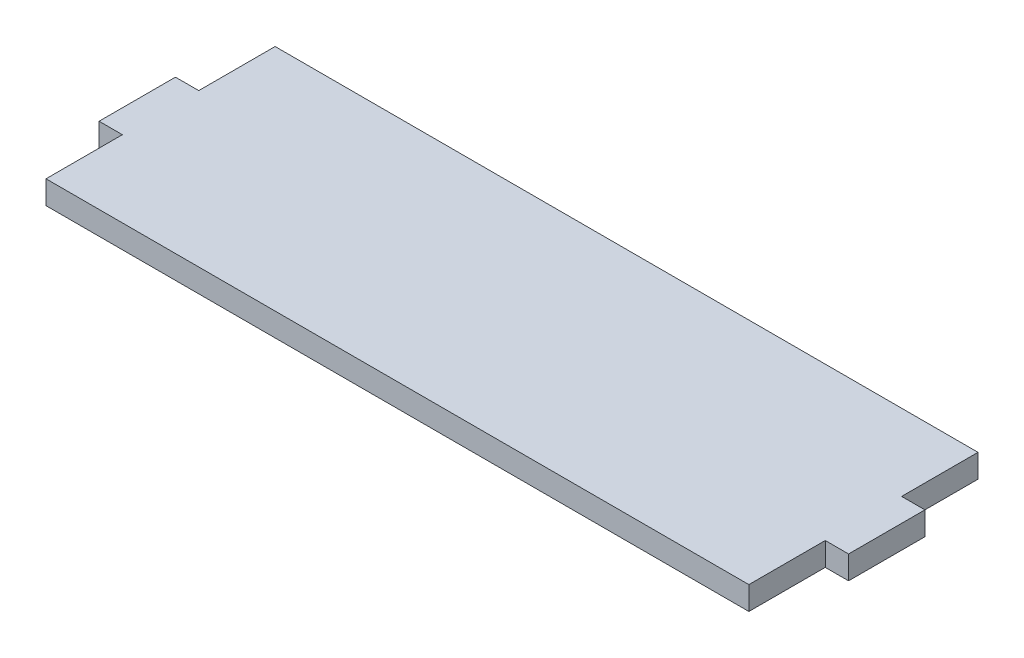
ISO-10303-21;
HEADER;
FILE_DESCRIPTION(('STEP AP214'),'2;1');
FILE_NAME('part.step','',(''),(''),'','','');
FILE_SCHEMA(('AUTOMOTIVE_DESIGN { 1 0 10303 214 1 1 1 1 }'));
ENDSEC;
DATA;
#1=APPLICATION_CONTEXT('core data for automotive mechanical design processes');
#2=APPLICATION_PROTOCOL_DEFINITION('international standard','automotive_design',2000,#1);
#3=PRODUCT_CONTEXT('',#1,'mechanical');
#4=PRODUCT('Part','Part','',(#3));
#5=PRODUCT_RELATED_PRODUCT_CATEGORY('part','',(#4));
#6=PRODUCT_DEFINITION_FORMATION('','',#4);
#7=PRODUCT_DEFINITION_CONTEXT('part definition',#1,'design');
#8=PRODUCT_DEFINITION('design','',#6,#7);
#9=PRODUCT_DEFINITION_SHAPE('','',#8);
#10=(LENGTH_UNIT() NAMED_UNIT(*) SI_UNIT(.MILLI.,.METRE.));
#11=(NAMED_UNIT(*) PLANE_ANGLE_UNIT() SI_UNIT($,.RADIAN.));
#12=(NAMED_UNIT(*) SI_UNIT($,.STERADIAN.) SOLID_ANGLE_UNIT());
#13=UNCERTAINTY_MEASURE_WITH_UNIT(LENGTH_MEASURE(1.E-05),#10,'distance_accuracy_value','');
#14=(GEOMETRIC_REPRESENTATION_CONTEXT(3) GLOBAL_UNCERTAINTY_ASSIGNED_CONTEXT((#13)) GLOBAL_UNIT_ASSIGNED_CONTEXT((#10,
#11,#12)) REPRESENTATION_CONTEXT('',''));
#15=CARTESIAN_POINT('',(0.,0.,0.));
#16=DIRECTION('',(0.,0.,1.));
#17=DIRECTION('',(1.,0.,0.));
#18=AXIS2_PLACEMENT_3D('',#15,#16,#17);
#19=CARTESIAN_POINT('',(-96.5,6.00000000000001,-29.5));
#20=DIRECTION('',(0.,0.,-1.));
#21=DIRECTION('',(-1.,0.,0.));
#22=AXIS2_PLACEMENT_3D('',#19,#20,#21);
#23=PLANE('',#22);
#24=DIRECTION('',(1.,0.,0.));
#25=VECTOR('',#24,1.);
#26=CARTESIAN_POINT('',(-96.5,6.00000000000001,-29.5));
#27=LINE('',#26,#25);
#28=CARTESIAN_POINT('',(-90.5,6.00000000000001,-29.5));
#29=VERTEX_POINT('',#28);
#30=CARTESIAN_POINT('',(90.5,6.00000000000001,-29.5));
#31=VERTEX_POINT('',#30);
#32=EDGE_CURVE('E156',#29,#31,#27,.T.);
#33=ORIENTED_EDGE('',*,*,#32,.T.);
#34=DIRECTION('',(0.,-1.,0.));
#35=VECTOR('',#34,1.);
#36=CARTESIAN_POINT('',(90.5,6.00000000000001,-29.5));
#37=LINE('',#36,#35);
#38=CARTESIAN_POINT('',(90.5,0.,-29.5));
#39=VERTEX_POINT('',#38);
#40=EDGE_CURVE('E209',#31,#39,#37,.T.);
#41=ORIENTED_EDGE('',*,*,#40,.T.);
#42=DIRECTION('',(1.,0.,0.));
#43=VECTOR('',#42,1.);
#44=CARTESIAN_POINT('',(-96.5,0.,-29.5));
#45=LINE('',#44,#43);
#46=CARTESIAN_POINT('',(-90.5,0.,-29.5));
#47=VERTEX_POINT('',#46);
#48=EDGE_CURVE('E160',#47,#39,#45,.T.);
#49=ORIENTED_EDGE('',*,*,#48,.F.);
#50=DIRECTION('',(0.,-1.,0.));
#51=VECTOR('',#50,1.);
#52=CARTESIAN_POINT('',(-90.5,6.00000000000001,-29.5));
#53=LINE('',#52,#51);
#54=EDGE_CURVE('E177',#29,#47,#53,.T.);
#55=ORIENTED_EDGE('',*,*,#54,.F.);
#56=EDGE_LOOP('',(#33,#41,#49,#55));
#57=FACE_BOUND('',#56,.T.);
#58=ADVANCED_FACE('F37',(#57),#23,.T.);
#59=CARTESIAN_POINT('',(-96.5,6.00000000000001,29.5));
#60=DIRECTION('',(0.,0.,-1.));
#61=DIRECTION('',(-1.,0.,0.));
#62=AXIS2_PLACEMENT_3D('',#59,#60,#61);
#63=PLANE('',#62);
#64=DIRECTION('',(0.,-1.,0.));
#65=VECTOR('',#64,1.);
#66=CARTESIAN_POINT('',(90.5,6.00000000000001,29.5));
#67=LINE('',#66,#65);
#68=CARTESIAN_POINT('',(90.5,6.00000000000001,29.5));
#69=VERTEX_POINT('',#68);
#70=CARTESIAN_POINT('',(90.5,0.,29.5));
#71=VERTEX_POINT('',#70);
#72=EDGE_CURVE('E129',#69,#71,#67,.T.);
#73=ORIENTED_EDGE('',*,*,#72,.F.);
#74=DIRECTION('',(1.,0.,0.));
#75=VECTOR('',#74,1.);
#76=CARTESIAN_POINT('',(-96.5,6.00000000000001,29.5));
#77=LINE('',#76,#75);
#78=CARTESIAN_POINT('',(-90.5,6.00000000000001,29.5));
#79=VERTEX_POINT('',#78);
#80=EDGE_CURVE('E45',#79,#69,#77,.T.);
#81=ORIENTED_EDGE('',*,*,#80,.F.);
#82=DIRECTION('',(0.,-1.,0.));
#83=VECTOR('',#82,1.);
#84=CARTESIAN_POINT('',(-90.5,6.00000000000001,29.5));
#85=LINE('',#84,#83);
#86=CARTESIAN_POINT('',(-90.5,0.,29.5));
#87=VERTEX_POINT('',#86);
#88=EDGE_CURVE('E197',#79,#87,#85,.T.);
#89=ORIENTED_EDGE('',*,*,#88,.T.);
#90=DIRECTION('',(1.,0.,0.));
#91=VECTOR('',#90,1.);
#92=CARTESIAN_POINT('',(-96.5,0.,29.5));
#93=LINE('',#92,#91);
#94=EDGE_CURVE('E144',#87,#71,#93,.T.);
#95=ORIENTED_EDGE('',*,*,#94,.T.);
#96=EDGE_LOOP('',(#73,#81,#89,#95));
#97=FACE_BOUND('',#96,.T.);
#98=ADVANCED_FACE('F141',(#97),#63,.F.);
#99=CARTESIAN_POINT('',(0.,6.00000000000001,0.));
#100=DIRECTION('',(0.,-1.,0.));
#101=DIRECTION('',(0.,0.,-1.));
#102=AXIS2_PLACEMENT_3D('',#99,#100,#101);
#103=PLANE('',#102);
#104=DIRECTION('',(0.,0.,1.));
#105=VECTOR('',#104,1.);
#106=CARTESIAN_POINT('',(90.5,6.00000000000001,0.));
#107=LINE('',#106,#105);
#108=CARTESIAN_POINT('',(90.5,6.00000000000001,9.83333333333334));
#109=VERTEX_POINT('',#108);
#110=EDGE_CURVE('E126',#109,#69,#107,.T.);
#111=ORIENTED_EDGE('',*,*,#110,.F.);
#112=DIRECTION('',(1.,0.,0.));
#113=VECTOR('',#112,1.);
#114=CARTESIAN_POINT('',(0.,6.00000000000001,9.83333333333331));
#115=LINE('',#114,#113);
#116=CARTESIAN_POINT('',(96.5,6.00000000000001,9.83333333333334));
#117=VERTEX_POINT('',#116);
#118=EDGE_CURVE('E135',#109,#117,#115,.T.);
#119=ORIENTED_EDGE('',*,*,#118,.T.);
#120=DIRECTION('',(0.,0.,1.));
#121=VECTOR('',#120,1.);
#122=CARTESIAN_POINT('',(96.5,6.00000000000001,-29.5));
#123=LINE('',#122,#121);
#124=CARTESIAN_POINT('',(96.5,6.00000000000001,-9.83333333333333));
#125=VERTEX_POINT('',#124);
#126=EDGE_CURVE('E153',#125,#117,#123,.T.);
#127=ORIENTED_EDGE('',*,*,#126,.F.);
#128=DIRECTION('',(-1.,0.,0.));
#129=VECTOR('',#128,1.);
#130=CARTESIAN_POINT('',(0.,6.00000000000001,-9.83333333333333));
#131=LINE('',#130,#129);
#132=CARTESIAN_POINT('',(90.5,6.00000000000001,-9.83333333333333));
#133=VERTEX_POINT('',#132);
#134=EDGE_CURVE('E211',#125,#133,#131,.T.);
#135=ORIENTED_EDGE('',*,*,#134,.T.);
#136=DIRECTION('',(0.,0.,1.));
#137=VECTOR('',#136,1.);
#138=CARTESIAN_POINT('',(90.5,6.00000000000001,0.));
#139=LINE('',#138,#137);
#140=EDGE_CURVE('E214',#31,#133,#139,.T.);
#141=ORIENTED_EDGE('',*,*,#140,.F.);
#142=ORIENTED_EDGE('',*,*,#32,.F.);
#143=DIRECTION('',(0.,0.,1.));
#144=VECTOR('',#143,1.);
#145=CARTESIAN_POINT('',(-90.5,6.00000000000001,0.));
#146=LINE('',#145,#144);
#147=CARTESIAN_POINT('',(-90.5,6.00000000000001,-9.83333333333333));
#148=VERTEX_POINT('',#147);
#149=EDGE_CURVE('E189',#29,#148,#146,.T.);
#150=ORIENTED_EDGE('',*,*,#149,.T.);
#151=DIRECTION('',(1.,0.,0.));
#152=VECTOR('',#151,1.);
#153=CARTESIAN_POINT('',(0.,6.00000000000001,-9.83333333333333));
#154=LINE('',#153,#152);
#155=CARTESIAN_POINT('',(-96.5,6.00000000000001,-9.83333333333333));
#156=VERTEX_POINT('',#155);
#157=EDGE_CURVE('E185',#156,#148,#154,.T.);
#158=ORIENTED_EDGE('',*,*,#157,.F.);
#159=DIRECTION('',(0.,0.,1.));
#160=VECTOR('',#159,1.);
#161=CARTESIAN_POINT('',(-96.5,6.00000000000001,-29.5));
#162=LINE('',#161,#160);
#163=CARTESIAN_POINT('',(-96.5,6.00000000000001,9.83333333333334));
#164=VERTEX_POINT('',#163);
#165=EDGE_CURVE('E11',#156,#164,#162,.T.);
#166=ORIENTED_EDGE('',*,*,#165,.T.);
#167=DIRECTION('',(-1.,0.,0.));
#168=VECTOR('',#167,1.);
#169=CARTESIAN_POINT('',(0.,6.00000000000001,9.83333333333331));
#170=LINE('',#169,#168);
#171=CARTESIAN_POINT('',(-90.5,6.00000000000001,9.83333333333334));
#172=VERTEX_POINT('',#171);
#173=EDGE_CURVE('E199',#172,#164,#170,.T.);
#174=ORIENTED_EDGE('',*,*,#173,.F.);
#175=DIRECTION('',(0.,0.,1.));
#176=VECTOR('',#175,1.);
#177=CARTESIAN_POINT('',(-90.5,6.00000000000001,0.));
#178=LINE('',#177,#176);
#179=EDGE_CURVE('E152',#172,#79,#178,.T.);
#180=ORIENTED_EDGE('',*,*,#179,.T.);
#181=ORIENTED_EDGE('',*,*,#80,.T.);
#182=EDGE_LOOP('',(#111,#119,#127,#135,#141,#142,#150,#158,#166,#174,#180,#181));
#183=FACE_BOUND('',#182,.T.);
#184=ADVANCED_FACE('F149',(#183),#103,.F.);
#185=CARTESIAN_POINT('',(0.,0.,0.));
#186=DIRECTION('',(0.,-1.,0.));
#187=DIRECTION('',(0.,0.,-1.));
#188=AXIS2_PLACEMENT_3D('',#185,#186,#187);
#189=PLANE('',#188);
#190=DIRECTION('',(1.,0.,0.));
#191=VECTOR('',#190,1.);
#192=CARTESIAN_POINT('',(0.,0.,9.83333333333331));
#193=LINE('',#192,#191);
#194=CARTESIAN_POINT('',(90.5,0.,9.83333333333334));
#195=VERTEX_POINT('',#194);
#196=CARTESIAN_POINT('',(96.5,0.,9.83333333333334));
#197=VERTEX_POINT('',#196);
#198=EDGE_CURVE('E136',#195,#197,#193,.T.);
#199=ORIENTED_EDGE('',*,*,#198,.F.);
#200=DIRECTION('',(0.,0.,1.));
#201=VECTOR('',#200,1.);
#202=CARTESIAN_POINT('',(90.5,0.,0.));
#203=LINE('',#202,#201);
#204=EDGE_CURVE('E53',#195,#71,#203,.T.);
#205=ORIENTED_EDGE('',*,*,#204,.T.);
#206=ORIENTED_EDGE('',*,*,#94,.F.);
#207=DIRECTION('',(0.,0.,1.));
#208=VECTOR('',#207,1.);
#209=CARTESIAN_POINT('',(-90.5,0.,0.));
#210=LINE('',#209,#208);
#211=CARTESIAN_POINT('',(-90.5,0.,9.83333333333334));
#212=VERTEX_POINT('',#211);
#213=EDGE_CURVE('E179',#212,#87,#210,.T.);
#214=ORIENTED_EDGE('',*,*,#213,.F.);
#215=DIRECTION('',(-1.,0.,0.));
#216=VECTOR('',#215,1.);
#217=CARTESIAN_POINT('',(0.,0.,9.83333333333331));
#218=LINE('',#217,#216);
#219=CARTESIAN_POINT('',(-96.5,0.,9.83333333333334));
#220=VERTEX_POINT('',#219);
#221=EDGE_CURVE('E200',#212,#220,#218,.T.);
#222=ORIENTED_EDGE('',*,*,#221,.T.);
#223=DIRECTION('',(0.,0.,1.));
#224=VECTOR('',#223,1.);
#225=CARTESIAN_POINT('',(-96.5,0.,-29.5));
#226=LINE('',#225,#224);
#227=CARTESIAN_POINT('',(-96.5,0.,-9.83333333333333));
#228=VERTEX_POINT('',#227);
#229=EDGE_CURVE('E40',#228,#220,#226,.T.);
#230=ORIENTED_EDGE('',*,*,#229,.F.);
#231=DIRECTION('',(1.,0.,0.));
#232=VECTOR('',#231,1.);
#233=CARTESIAN_POINT('',(0.,0.,-9.83333333333333));
#234=LINE('',#233,#232);
#235=CARTESIAN_POINT('',(-90.5,0.,-9.83333333333333));
#236=VERTEX_POINT('',#235);
#237=EDGE_CURVE('E186',#228,#236,#234,.T.);
#238=ORIENTED_EDGE('',*,*,#237,.T.);
#239=DIRECTION('',(0.,0.,1.));
#240=VECTOR('',#239,1.);
#241=CARTESIAN_POINT('',(-90.5,0.,0.));
#242=LINE('',#241,#240);
#243=EDGE_CURVE('E145',#47,#236,#242,.T.);
#244=ORIENTED_EDGE('',*,*,#243,.F.);
#245=ORIENTED_EDGE('',*,*,#48,.T.);
#246=DIRECTION('',(0.,0.,1.));
#247=VECTOR('',#246,1.);
#248=CARTESIAN_POINT('',(90.5,0.,0.));
#249=LINE('',#248,#247);
#250=CARTESIAN_POINT('',(90.5,0.,-9.83333333333333));
#251=VERTEX_POINT('',#250);
#252=EDGE_CURVE('E215',#39,#251,#249,.T.);
#253=ORIENTED_EDGE('',*,*,#252,.T.);
#254=DIRECTION('',(-1.,0.,0.));
#255=VECTOR('',#254,1.);
#256=CARTESIAN_POINT('',(0.,0.,-9.83333333333333));
#257=LINE('',#256,#255);
#258=CARTESIAN_POINT('',(96.5,0.,-9.83333333333333));
#259=VERTEX_POINT('',#258);
#260=EDGE_CURVE('E212',#259,#251,#257,.T.);
#261=ORIENTED_EDGE('',*,*,#260,.F.);
#262=DIRECTION('',(0.,0.,1.));
#263=VECTOR('',#262,1.);
#264=CARTESIAN_POINT('',(96.5,0.,-29.5));
#265=LINE('',#264,#263);
#266=EDGE_CURVE('E163',#259,#197,#265,.T.);
#267=ORIENTED_EDGE('',*,*,#266,.T.);
#268=EDGE_LOOP('',(#199,#205,#206,#214,#222,#230,#238,#244,#245,#253,#261,#267));
#269=FACE_BOUND('',#268,.T.);
#270=ADVANCED_FACE('F233',(#269),#189,.T.);
#271=CARTESIAN_POINT('',(-96.5,6.00000000000001,-29.5));
#272=DIRECTION('',(1.,0.,0.));
#273=DIRECTION('',(0.,0.,-1.));
#274=AXIS2_PLACEMENT_3D('',#271,#272,#273);
#275=PLANE('',#274);
#276=DIRECTION('',(0.,-1.,0.));
#277=VECTOR('',#276,1.);
#278=CARTESIAN_POINT('',(-96.5,6.00000000000001,9.83333333333334));
#279=LINE('',#278,#277);
#280=EDGE_CURVE('E195',#164,#220,#279,.T.);
#281=ORIENTED_EDGE('',*,*,#280,.F.);
#282=ORIENTED_EDGE('',*,*,#165,.F.);
#283=DIRECTION('',(0.,-1.,0.));
#284=VECTOR('',#283,1.);
#285=CARTESIAN_POINT('',(-96.5,6.00000000000001,-9.83333333333333));
#286=LINE('',#285,#284);
#287=EDGE_CURVE('E180',#156,#228,#286,.T.);
#288=ORIENTED_EDGE('',*,*,#287,.T.);
#289=ORIENTED_EDGE('',*,*,#229,.T.);
#290=EDGE_LOOP('',(#281,#282,#288,#289));
#291=FACE_BOUND('',#290,.T.);
#292=ADVANCED_FACE('F248',(#291),#275,.F.);
#293=CARTESIAN_POINT('',(96.5,6.00000000000001,-29.5));
#294=DIRECTION('',(1.,0.,0.));
#295=DIRECTION('',(0.,0.,-1.));
#296=AXIS2_PLACEMENT_3D('',#293,#294,#295);
#297=PLANE('',#296);
#298=DIRECTION('',(0.,-1.,0.));
#299=VECTOR('',#298,1.);
#300=CARTESIAN_POINT('',(96.5,6.00000000000001,9.83333333333334));
#301=LINE('',#300,#299);
#302=EDGE_CURVE('E146',#117,#197,#301,.T.);
#303=ORIENTED_EDGE('',*,*,#302,.T.);
#304=ORIENTED_EDGE('',*,*,#266,.F.);
#305=DIRECTION('',(0.,-1.,0.));
#306=VECTOR('',#305,1.);
#307=CARTESIAN_POINT('',(96.5,6.00000000000001,-9.83333333333333));
#308=LINE('',#307,#306);
#309=EDGE_CURVE('E61',#125,#259,#308,.T.);
#310=ORIENTED_EDGE('',*,*,#309,.F.);
#311=ORIENTED_EDGE('',*,*,#126,.T.);
#312=EDGE_LOOP('',(#303,#304,#310,#311));
#313=FACE_BOUND('',#312,.T.);
#314=ADVANCED_FACE('F229',(#313),#297,.T.);
#315=CARTESIAN_POINT('',(-90.5,6.00000000000001,0.));
#316=DIRECTION('',(1.,0.,0.));
#317=DIRECTION('',(0.,0.,-1.));
#318=AXIS2_PLACEMENT_3D('',#315,#316,#317);
#319=PLANE('',#318);
#320=ORIENTED_EDGE('',*,*,#243,.T.);
#321=DIRECTION('',(0.,-1.,0.));
#322=VECTOR('',#321,1.);
#323=CARTESIAN_POINT('',(-90.5,6.00000000000001,-9.83333333333333));
#324=LINE('',#323,#322);
#325=EDGE_CURVE('E182',#148,#236,#324,.T.);
#326=ORIENTED_EDGE('',*,*,#325,.F.);
#327=ORIENTED_EDGE('',*,*,#149,.F.);
#328=ORIENTED_EDGE('',*,*,#54,.T.);
#329=EDGE_LOOP('',(#320,#326,#327,#328));
#330=FACE_BOUND('',#329,.T.);
#331=ADVANCED_FACE('F243',(#330),#319,.F.);
#332=CARTESIAN_POINT('',(0.,6.00000000000001,-9.83333333333333));
#333=DIRECTION('',(0.,0.,-1.));
#334=DIRECTION('',(-1.,0.,0.));
#335=AXIS2_PLACEMENT_3D('',#332,#333,#334);
#336=PLANE('',#335);
#337=ORIENTED_EDGE('',*,*,#237,.F.);
#338=ORIENTED_EDGE('',*,*,#287,.F.);
#339=ORIENTED_EDGE('',*,*,#157,.T.);
#340=ORIENTED_EDGE('',*,*,#325,.T.);
#341=EDGE_LOOP('',(#337,#338,#339,#340));
#342=FACE_BOUND('',#341,.T.);
#343=ADVANCED_FACE('F245',(#342),#336,.T.);
#344=CARTESIAN_POINT('',(-90.5,6.00000000000001,0.));
#345=DIRECTION('',(1.,0.,0.));
#346=DIRECTION('',(0.,0.,-1.));
#347=AXIS2_PLACEMENT_3D('',#344,#345,#346);
#348=PLANE('',#347);
#349=ORIENTED_EDGE('',*,*,#213,.T.);
#350=ORIENTED_EDGE('',*,*,#88,.F.);
#351=ORIENTED_EDGE('',*,*,#179,.F.);
#352=DIRECTION('',(0.,-1.,0.));
#353=VECTOR('',#352,1.);
#354=CARTESIAN_POINT('',(-90.5,6.00000000000001,9.83333333333334));
#355=LINE('',#354,#353);
#356=EDGE_CURVE('E164',#172,#212,#355,.T.);
#357=ORIENTED_EDGE('',*,*,#356,.T.);
#358=EDGE_LOOP('',(#349,#350,#351,#357));
#359=FACE_BOUND('',#358,.T.);
#360=ADVANCED_FACE('F254',(#359),#348,.F.);
#361=CARTESIAN_POINT('',(0.,6.00000000000001,9.83333333333331));
#362=DIRECTION('',(0.,0.,1.));
#363=DIRECTION('',(1.,0.,0.));
#364=AXIS2_PLACEMENT_3D('',#361,#362,#363);
#365=PLANE('',#364);
#366=ORIENTED_EDGE('',*,*,#221,.F.);
#367=ORIENTED_EDGE('',*,*,#356,.F.);
#368=ORIENTED_EDGE('',*,*,#173,.T.);
#369=ORIENTED_EDGE('',*,*,#280,.T.);
#370=EDGE_LOOP('',(#366,#367,#368,#369));
#371=FACE_BOUND('',#370,.T.);
#372=ADVANCED_FACE('F251',(#371),#365,.T.);
#373=CARTESIAN_POINT('',(90.5,6.00000000000001,0.));
#374=DIRECTION('',(1.,0.,0.));
#375=DIRECTION('',(0.,0.,-1.));
#376=AXIS2_PLACEMENT_3D('',#373,#374,#375);
#377=PLANE('',#376);
#378=ORIENTED_EDGE('',*,*,#252,.F.);
#379=ORIENTED_EDGE('',*,*,#40,.F.);
#380=ORIENTED_EDGE('',*,*,#140,.T.);
#381=DIRECTION('',(0.,-1.,0.));
#382=VECTOR('',#381,1.);
#383=CARTESIAN_POINT('',(90.5,6.00000000000001,-9.83333333333333));
#384=LINE('',#383,#382);
#385=EDGE_CURVE('E206',#133,#251,#384,.T.);
#386=ORIENTED_EDGE('',*,*,#385,.T.);
#387=EDGE_LOOP('',(#378,#379,#380,#386));
#388=FACE_BOUND('',#387,.T.);
#389=ADVANCED_FACE('F238',(#388),#377,.T.);
#390=CARTESIAN_POINT('',(0.,6.00000000000001,-9.83333333333333));
#391=DIRECTION('',(0.,0.,1.));
#392=DIRECTION('',(1.,0.,0.));
#393=AXIS2_PLACEMENT_3D('',#390,#391,#392);
#394=PLANE('',#393);
#395=ORIENTED_EDGE('',*,*,#260,.T.);
#396=ORIENTED_EDGE('',*,*,#385,.F.);
#397=ORIENTED_EDGE('',*,*,#134,.F.);
#398=ORIENTED_EDGE('',*,*,#309,.T.);
#399=EDGE_LOOP('',(#395,#396,#397,#398));
#400=FACE_BOUND('',#399,.T.);
#401=ADVANCED_FACE('F235',(#400),#394,.F.);
#402=CARTESIAN_POINT('',(90.5,6.00000000000001,0.));
#403=DIRECTION('',(1.,0.,0.));
#404=DIRECTION('',(0.,0.,-1.));
#405=AXIS2_PLACEMENT_3D('',#402,#403,#404);
#406=PLANE('',#405);
#407=ORIENTED_EDGE('',*,*,#204,.F.);
#408=DIRECTION('',(0.,-1.,0.));
#409=VECTOR('',#408,1.);
#410=CARTESIAN_POINT('',(90.5,6.00000000000001,9.83333333333334));
#411=LINE('',#410,#409);
#412=EDGE_CURVE('E130',#109,#195,#411,.T.);
#413=ORIENTED_EDGE('',*,*,#412,.F.);
#414=ORIENTED_EDGE('',*,*,#110,.T.);
#415=ORIENTED_EDGE('',*,*,#72,.T.);
#416=EDGE_LOOP('',(#407,#413,#414,#415));
#417=FACE_BOUND('',#416,.T.);
#418=ADVANCED_FACE('F128',(#417),#406,.T.);
#419=CARTESIAN_POINT('',(0.,6.00000000000001,9.83333333333331));
#420=DIRECTION('',(0.,0.,-1.));
#421=DIRECTION('',(-1.,0.,0.));
#422=AXIS2_PLACEMENT_3D('',#419,#420,#421);
#423=PLANE('',#422);
#424=ORIENTED_EDGE('',*,*,#198,.T.);
#425=ORIENTED_EDGE('',*,*,#302,.F.);
#426=ORIENTED_EDGE('',*,*,#118,.F.);
#427=ORIENTED_EDGE('',*,*,#412,.T.);
#428=EDGE_LOOP('',(#424,#425,#426,#427));
#429=FACE_BOUND('',#428,.T.);
#430=ADVANCED_FACE('F363',(#429),#423,.F.);
#431=CLOSED_SHELL('',(#58,#98,#184,#270,#292,#314,#331,#343,#360,#372,#389,#401,#418,#430));
#432=MANIFOLD_SOLID_BREP('B2',#431);
#433=ADVANCED_BREP_SHAPE_REPRESENTATION('',(#18,#432),#14);
#434=SHAPE_DEFINITION_REPRESENTATION(#9,#433);
ENDSEC;
END-ISO-10303-21;
